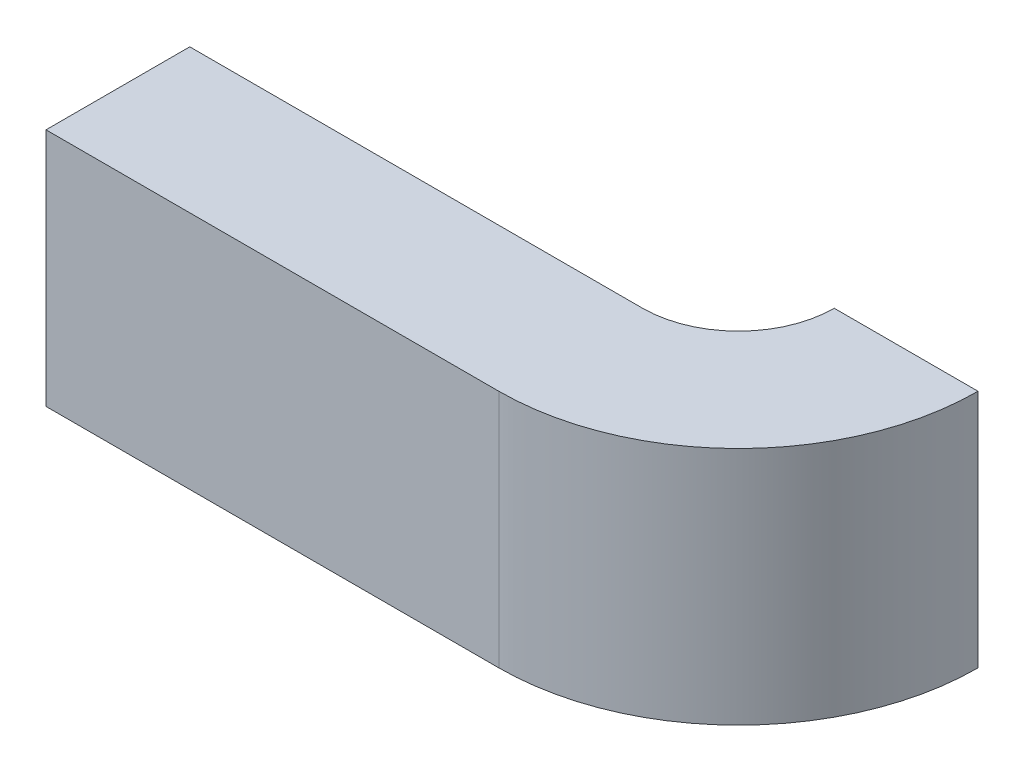
ISO-10303-21;
HEADER;
FILE_DESCRIPTION(('STEP AP214'),'2;1');
FILE_NAME('part.step','',(''),(''),'','','');
FILE_SCHEMA(('AUTOMOTIVE_DESIGN { 1 0 10303 214 1 1 1 1 }'));
ENDSEC;
DATA;
#1=APPLICATION_CONTEXT('core data for automotive mechanical design processes');
#2=APPLICATION_PROTOCOL_DEFINITION('international standard','automotive_design',2000,#1);
#3=PRODUCT_CONTEXT('',#1,'mechanical');
#4=PRODUCT('Part','Part','',(#3));
#5=PRODUCT_RELATED_PRODUCT_CATEGORY('part','',(#4));
#6=PRODUCT_DEFINITION_FORMATION('','',#4);
#7=PRODUCT_DEFINITION_CONTEXT('part definition',#1,'design');
#8=PRODUCT_DEFINITION('design','',#6,#7);
#9=PRODUCT_DEFINITION_SHAPE('','',#8);
#10=(LENGTH_UNIT() NAMED_UNIT(*) SI_UNIT(.MILLI.,.METRE.));
#11=(NAMED_UNIT(*) PLANE_ANGLE_UNIT() SI_UNIT($,.RADIAN.));
#12=(NAMED_UNIT(*) SI_UNIT($,.STERADIAN.) SOLID_ANGLE_UNIT());
#13=UNCERTAINTY_MEASURE_WITH_UNIT(LENGTH_MEASURE(1.E-05),#10,'distance_accuracy_value','');
#14=(GEOMETRIC_REPRESENTATION_CONTEXT(3) GLOBAL_UNCERTAINTY_ASSIGNED_CONTEXT((#13)) GLOBAL_UNIT_ASSIGNED_CONTEXT((#10,
#11,#12)) REPRESENTATION_CONTEXT('',''));
#15=CARTESIAN_POINT('',(0.,0.,0.));
#16=DIRECTION('',(0.,0.,1.));
#17=DIRECTION('',(1.,0.,0.));
#18=AXIS2_PLACEMENT_3D('',#15,#16,#17);
#19=CARTESIAN_POINT('',(0.,0.25,0.15));
#20=DIRECTION('',(1.,0.,0.));
#21=DIRECTION('',(0.,0.,-1.));
#22=AXIS2_PLACEMENT_3D('',#19,#20,#21);
#23=PLANE('',#22);
#24=DIRECTION('',(0.,0.,1.));
#25=VECTOR('',#24,1.);
#26=CARTESIAN_POINT('',(0.,-0.25,0.15));
#27=LINE('',#26,#25);
#28=CARTESIAN_POINT('',(0.,-0.25,-0.15));
#29=VERTEX_POINT('',#28);
#30=CARTESIAN_POINT('',(0.,-0.25,0.15));
#31=VERTEX_POINT('',#30);
#32=EDGE_CURVE('E120',#29,#31,#27,.T.);
#33=ORIENTED_EDGE('',*,*,#32,.T.);
#34=DIRECTION('',(0.,-1.,0.));
#35=VECTOR('',#34,1.);
#36=CARTESIAN_POINT('',(0.,0.25,0.15));
#37=LINE('',#36,#35);
#38=CARTESIAN_POINT('',(0.,0.25,0.15));
#39=VERTEX_POINT('',#38);
#40=EDGE_CURVE('E11',#39,#31,#37,.T.);
#41=ORIENTED_EDGE('',*,*,#40,.F.);
#42=DIRECTION('',(0.,0.,1.));
#43=VECTOR('',#42,1.);
#44=CARTESIAN_POINT('',(0.,0.25,0.15));
#45=LINE('',#44,#43);
#46=CARTESIAN_POINT('',(0.,0.25,-0.15));
#47=VERTEX_POINT('',#46);
#48=EDGE_CURVE('E130',#47,#39,#45,.T.);
#49=ORIENTED_EDGE('',*,*,#48,.F.);
#50=DIRECTION('',(0.,-1.,0.));
#51=VECTOR('',#50,1.);
#52=CARTESIAN_POINT('',(0.,0.25,-0.15));
#53=LINE('',#52,#51);
#54=EDGE_CURVE('E116',#47,#29,#53,.T.);
#55=ORIENTED_EDGE('',*,*,#54,.T.);
#56=EDGE_LOOP('',(#33,#41,#49,#55));
#57=FACE_BOUND('',#56,.T.);
#58=ADVANCED_FACE('F36',(#57),#23,.F.);
#59=CARTESIAN_POINT('',(0.,0.25,0.15));
#60=DIRECTION('',(0.,0.,-1.));
#61=DIRECTION('',(-1.,0.,0.));
#62=AXIS2_PLACEMENT_3D('',#59,#60,#61);
#63=PLANE('',#62);
#64=DIRECTION('',(1.,0.,0.));
#65=VECTOR('',#64,1.);
#66=CARTESIAN_POINT('',(0.,-0.25,0.15));
#67=LINE('',#66,#65);
#68=CARTESIAN_POINT('',(0.945,-0.25,0.15));
#69=VERTEX_POINT('',#68);
#70=EDGE_CURVE('E123',#31,#69,#67,.T.);
#71=ORIENTED_EDGE('',*,*,#70,.T.);
#72=DIRECTION('',(0.,-1.,0.));
#73=VECTOR('',#72,1.);
#74=CARTESIAN_POINT('',(0.945,0.25,0.15));
#75=LINE('',#74,#73);
#76=CARTESIAN_POINT('',(0.945,0.25,0.15));
#77=VERTEX_POINT('',#76);
#78=EDGE_CURVE('E44',#77,#69,#75,.T.);
#79=ORIENTED_EDGE('',*,*,#78,.F.);
#80=DIRECTION('',(1.,0.,0.));
#81=VECTOR('',#80,1.);
#82=CARTESIAN_POINT('',(0.,0.25,0.15));
#83=LINE('',#82,#81);
#84=EDGE_CURVE('E89',#39,#77,#83,.T.);
#85=ORIENTED_EDGE('',*,*,#84,.F.);
#86=ORIENTED_EDGE('',*,*,#40,.T.);
#87=EDGE_LOOP('',(#71,#79,#85,#86));
#88=FACE_BOUND('',#87,.T.);
#89=ADVANCED_FACE('F154',(#88),#63,.F.);
#90=CARTESIAN_POINT('',(0.945,0.25,-0.35));
#91=DIRECTION('',(0.,-1.,0.));
#92=DIRECTION('',(0.,0.,-1.));
#93=AXIS2_PLACEMENT_3D('',#90,#91,#92);
#94=CYLINDRICAL_SURFACE('',#93,0.5);
#95=CARTESIAN_POINT('',(0.945,-0.25,-0.35));
#96=DIRECTION('',(0.,1.,0.));
#97=DIRECTION('',(0.,0.,1.));
#98=AXIS2_PLACEMENT_3D('',#95,#96,#97);
#99=CIRCLE('',#98,0.5);
#100=CARTESIAN_POINT('',(1.445,-0.25,-0.35));
#101=VERTEX_POINT('',#100);
#102=EDGE_CURVE('E125',#69,#101,#99,.T.);
#103=ORIENTED_EDGE('',*,*,#102,.T.);
#104=DIRECTION('',(0.,-1.,0.));
#105=VECTOR('',#104,1.);
#106=CARTESIAN_POINT('',(1.445,0.25,-0.35));
#107=LINE('',#106,#105);
#108=CARTESIAN_POINT('',(1.445,0.25,-0.35));
#109=VERTEX_POINT('',#108);
#110=EDGE_CURVE('E111',#109,#101,#107,.T.);
#111=ORIENTED_EDGE('',*,*,#110,.F.);
#112=CARTESIAN_POINT('',(0.945,0.25,-0.35));
#113=DIRECTION('',(0.,1.,0.));
#114=DIRECTION('',(0.,0.,1.));
#115=AXIS2_PLACEMENT_3D('',#112,#113,#114);
#116=CIRCLE('',#115,0.5);
#117=EDGE_CURVE('E102',#77,#109,#116,.T.);
#118=ORIENTED_EDGE('',*,*,#117,.F.);
#119=ORIENTED_EDGE('',*,*,#78,.T.);
#120=EDGE_LOOP('',(#103,#111,#118,#119));
#121=FACE_BOUND('',#120,.T.);
#122=ADVANCED_FACE('F136',(#121),#94,.T.);
#123=CARTESIAN_POINT('',(1.445,0.25,-0.35));
#124=DIRECTION('',(0.,0.,1.));
#125=DIRECTION('',(1.,0.,0.));
#126=AXIS2_PLACEMENT_3D('',#123,#124,#125);
#127=PLANE('',#126);
#128=DIRECTION('',(-1.,0.,0.));
#129=VECTOR('',#128,1.);
#130=CARTESIAN_POINT('',(1.445,-0.25,-0.35));
#131=LINE('',#130,#129);
#132=CARTESIAN_POINT('',(1.145,-0.25,-0.35));
#133=VERTEX_POINT('',#132);
#134=EDGE_CURVE('E110',#101,#133,#131,.T.);
#135=ORIENTED_EDGE('',*,*,#134,.T.);
#136=DIRECTION('',(0.,-1.,0.));
#137=VECTOR('',#136,1.);
#138=CARTESIAN_POINT('',(1.145,0.25,-0.35));
#139=LINE('',#138,#137);
#140=CARTESIAN_POINT('',(1.145,0.25,-0.35));
#141=VERTEX_POINT('',#140);
#142=EDGE_CURVE('E107',#141,#133,#139,.T.);
#143=ORIENTED_EDGE('',*,*,#142,.F.);
#144=DIRECTION('',(-1.,0.,0.));
#145=VECTOR('',#144,1.);
#146=CARTESIAN_POINT('',(1.445,0.25,-0.35));
#147=LINE('',#146,#145);
#148=EDGE_CURVE('E96',#109,#141,#147,.T.);
#149=ORIENTED_EDGE('',*,*,#148,.F.);
#150=ORIENTED_EDGE('',*,*,#110,.T.);
#151=EDGE_LOOP('',(#135,#143,#149,#150));
#152=FACE_BOUND('',#151,.T.);
#153=ADVANCED_FACE('F108',(#152),#127,.F.);
#154=CARTESIAN_POINT('',(0.945,0.25,-0.35));
#155=DIRECTION('',(0.,-1.,0.));
#156=DIRECTION('',(0.,0.,-1.));
#157=AXIS2_PLACEMENT_3D('',#154,#155,#156);
#158=CYLINDRICAL_SURFACE('',#157,0.2);
#159=CARTESIAN_POINT('',(0.945,-0.25,-0.35));
#160=DIRECTION('',(0.,-1.,0.));
#161=DIRECTION('',(0.,0.,1.));
#162=AXIS2_PLACEMENT_3D('',#159,#160,#161);
#163=CIRCLE('',#162,0.2);
#164=CARTESIAN_POINT('',(0.945,-0.25,-0.15));
#165=VERTEX_POINT('',#164);
#166=EDGE_CURVE('E75',#133,#165,#163,.T.);
#167=ORIENTED_EDGE('',*,*,#166,.T.);
#168=DIRECTION('',(0.,-1.,0.));
#169=VECTOR('',#168,1.);
#170=CARTESIAN_POINT('',(0.945,0.25,-0.15));
#171=LINE('',#170,#169);
#172=CARTESIAN_POINT('',(0.945,0.25,-0.15));
#173=VERTEX_POINT('',#172);
#174=EDGE_CURVE('E112',#173,#165,#171,.T.);
#175=ORIENTED_EDGE('',*,*,#174,.F.);
#176=CARTESIAN_POINT('',(0.945,0.25,-0.35));
#177=DIRECTION('',(0.,-1.,0.));
#178=DIRECTION('',(0.,0.,1.));
#179=AXIS2_PLACEMENT_3D('',#176,#177,#178);
#180=CIRCLE('',#179,0.2);
#181=EDGE_CURVE('E100',#141,#173,#180,.T.);
#182=ORIENTED_EDGE('',*,*,#181,.F.);
#183=ORIENTED_EDGE('',*,*,#142,.T.);
#184=EDGE_LOOP('',(#167,#175,#182,#183));
#185=FACE_BOUND('',#184,.T.);
#186=ADVANCED_FACE('F114',(#185),#158,.F.);
#187=CARTESIAN_POINT('',(0.,0.25,-0.15));
#188=DIRECTION('',(0.,0.,1.));
#189=DIRECTION('',(1.,0.,0.));
#190=AXIS2_PLACEMENT_3D('',#187,#188,#189);
#191=PLANE('',#190);
#192=DIRECTION('',(-1.,0.,0.));
#193=VECTOR('',#192,1.);
#194=CARTESIAN_POINT('',(0.,-0.25,-0.15));
#195=LINE('',#194,#193);
#196=EDGE_CURVE('E81',#165,#29,#195,.T.);
#197=ORIENTED_EDGE('',*,*,#196,.T.);
#198=ORIENTED_EDGE('',*,*,#54,.F.);
#199=DIRECTION('',(-1.,0.,0.));
#200=VECTOR('',#199,1.);
#201=CARTESIAN_POINT('',(0.,0.25,-0.15));
#202=LINE('',#201,#200);
#203=EDGE_CURVE('E52',#173,#47,#202,.T.);
#204=ORIENTED_EDGE('',*,*,#203,.F.);
#205=ORIENTED_EDGE('',*,*,#174,.T.);
#206=EDGE_LOOP('',(#197,#198,#204,#205));
#207=FACE_BOUND('',#206,.T.);
#208=ADVANCED_FACE('F143',(#207),#191,.F.);
#209=CARTESIAN_POINT('',(0.945,0.25,-0.35));
#210=DIRECTION('',(0.,1.,0.));
#211=DIRECTION('',(0.,0.,1.));
#212=AXIS2_PLACEMENT_3D('',#209,#210,#211);
#213=PLANE('',#212);
#214=ORIENTED_EDGE('',*,*,#48,.T.);
#215=ORIENTED_EDGE('',*,*,#84,.T.);
#216=ORIENTED_EDGE('',*,*,#117,.T.);
#217=ORIENTED_EDGE('',*,*,#148,.T.);
#218=ORIENTED_EDGE('',*,*,#181,.T.);
#219=ORIENTED_EDGE('',*,*,#203,.T.);
#220=EDGE_LOOP('',(#214,#215,#216,#217,#218,#219));
#221=FACE_BOUND('',#220,.T.);
#222=ADVANCED_FACE('F98',(#221),#213,.T.);
#223=CARTESIAN_POINT('',(0.945,-0.25,-0.35));
#224=DIRECTION('',(0.,1.,0.));
#225=DIRECTION('',(0.,0.,1.));
#226=AXIS2_PLACEMENT_3D('',#223,#224,#225);
#227=PLANE('',#226);
#228=ORIENTED_EDGE('',*,*,#32,.F.);
#229=ORIENTED_EDGE('',*,*,#196,.F.);
#230=ORIENTED_EDGE('',*,*,#166,.F.);
#231=ORIENTED_EDGE('',*,*,#134,.F.);
#232=ORIENTED_EDGE('',*,*,#102,.F.);
#233=ORIENTED_EDGE('',*,*,#70,.F.);
#234=EDGE_LOOP('',(#228,#229,#230,#231,#232,#233));
#235=FACE_BOUND('',#234,.T.);
#236=ADVANCED_FACE('F139',(#235),#227,.F.);
#237=CLOSED_SHELL('',(#58,#89,#122,#153,#186,#208,#222,#236));
#238=MANIFOLD_SOLID_BREP('B2',#237);
#239=ADVANCED_BREP_SHAPE_REPRESENTATION('',(#18,#238),#14);
#240=SHAPE_DEFINITION_REPRESENTATION(#9,#239);
ENDSEC;
END-ISO-10303-21;
